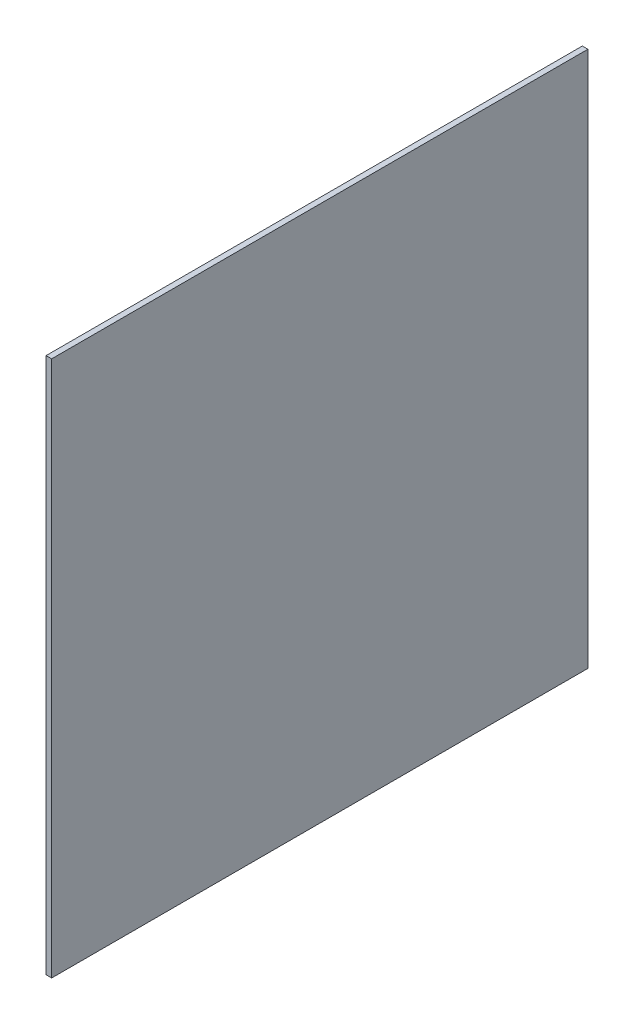
ISO-10303-21;
HEADER;
FILE_DESCRIPTION(('STEP AP214'),'2;1');
FILE_NAME('part.step','',(''),(''),'','','');
FILE_SCHEMA(('AUTOMOTIVE_DESIGN { 1 0 10303 214 1 1 1 1 }'));
ENDSEC;
DATA;
#1=APPLICATION_CONTEXT('core data for automotive mechanical design processes');
#2=APPLICATION_PROTOCOL_DEFINITION('international standard','automotive_design',2000,#1);
#3=PRODUCT_CONTEXT('',#1,'mechanical');
#4=PRODUCT('Part','Part','',(#3));
#5=PRODUCT_RELATED_PRODUCT_CATEGORY('part','',(#4));
#6=PRODUCT_DEFINITION_FORMATION('','',#4);
#7=PRODUCT_DEFINITION_CONTEXT('part definition',#1,'design');
#8=PRODUCT_DEFINITION('design','',#6,#7);
#9=PRODUCT_DEFINITION_SHAPE('','',#8);
#10=(LENGTH_UNIT() NAMED_UNIT(*) SI_UNIT(.MILLI.,.METRE.));
#11=(NAMED_UNIT(*) PLANE_ANGLE_UNIT() SI_UNIT($,.RADIAN.));
#12=(NAMED_UNIT(*) SI_UNIT($,.STERADIAN.) SOLID_ANGLE_UNIT());
#13=UNCERTAINTY_MEASURE_WITH_UNIT(LENGTH_MEASURE(1.E-05),#10,'distance_accuracy_value','');
#14=(GEOMETRIC_REPRESENTATION_CONTEXT(3) GLOBAL_UNCERTAINTY_ASSIGNED_CONTEXT((#13)) GLOBAL_UNIT_ASSIGNED_CONTEXT((#10,
#11,#12)) REPRESENTATION_CONTEXT('',''));
#15=CARTESIAN_POINT('',(0.,0.,0.));
#16=DIRECTION('',(0.,0.,1.));
#17=DIRECTION('',(1.,0.,0.));
#18=AXIS2_PLACEMENT_3D('',#15,#16,#17);
#19=CARTESIAN_POINT('',(1.5875,152.4,152.4));
#20=DIRECTION('',(0.,0.,-1.));
#21=DIRECTION('',(0.,1.,0.));
#22=AXIS2_PLACEMENT_3D('',#19,#20,#21);
#23=PLANE('',#22);
#24=DIRECTION('',(0.,-1.,0.));
#25=VECTOR('',#24,1.);
#26=CARTESIAN_POINT('',(-1.5875,152.4,152.4));
#27=LINE('',#26,#25);
#28=CARTESIAN_POINT('',(-1.5875,152.4,152.4));
#29=VERTEX_POINT('',#28);
#30=CARTESIAN_POINT('',(-1.5875,-152.4,152.4));
#31=VERTEX_POINT('',#30);
#32=EDGE_CURVE('E97',#29,#31,#27,.T.);
#33=ORIENTED_EDGE('',*,*,#32,.T.);
#34=DIRECTION('',(-1.,0.,0.));
#35=VECTOR('',#34,1.);
#36=CARTESIAN_POINT('',(1.5875,-152.4,152.4));
#37=LINE('',#36,#35);
#38=CARTESIAN_POINT('',(1.5875,-152.4,152.4));
#39=VERTEX_POINT('',#38);
#40=EDGE_CURVE('E11',#39,#31,#37,.T.);
#41=ORIENTED_EDGE('',*,*,#40,.F.);
#42=DIRECTION('',(0.,-1.,0.));
#43=VECTOR('',#42,1.);
#44=CARTESIAN_POINT('',(1.5875,152.4,152.4));
#45=LINE('',#44,#43);
#46=CARTESIAN_POINT('',(1.5875,152.4,152.4));
#47=VERTEX_POINT('',#46);
#48=EDGE_CURVE('E85',#47,#39,#45,.T.);
#49=ORIENTED_EDGE('',*,*,#48,.F.);
#50=DIRECTION('',(-1.,0.,0.));
#51=VECTOR('',#50,1.);
#52=CARTESIAN_POINT('',(1.5875,152.4,152.4));
#53=LINE('',#52,#51);
#54=EDGE_CURVE('E93',#47,#29,#53,.T.);
#55=ORIENTED_EDGE('',*,*,#54,.T.);
#56=EDGE_LOOP('',(#33,#41,#49,#55));
#57=FACE_BOUND('',#56,.T.);
#58=ADVANCED_FACE('F34',(#57),#23,.F.);
#59=CARTESIAN_POINT('',(1.5875,-152.4,-152.4));
#60=DIRECTION('',(0.,1.,0.));
#61=DIRECTION('',(0.,0.,1.));
#62=AXIS2_PLACEMENT_3D('',#59,#60,#61);
#63=PLANE('',#62);
#64=DIRECTION('',(0.,0.,-1.));
#65=VECTOR('',#64,1.);
#66=CARTESIAN_POINT('',(-1.5875,-152.4,-152.4));
#67=LINE('',#66,#65);
#68=CARTESIAN_POINT('',(-1.5875,-152.4,-152.4));
#69=VERTEX_POINT('',#68);
#70=EDGE_CURVE('E89',#31,#69,#67,.T.);
#71=ORIENTED_EDGE('',*,*,#70,.T.);
#72=DIRECTION('',(-1.,0.,0.));
#73=VECTOR('',#72,1.);
#74=CARTESIAN_POINT('',(1.5875,-152.4,-152.4));
#75=LINE('',#74,#73);
#76=CARTESIAN_POINT('',(1.5875,-152.4,-152.4));
#77=VERTEX_POINT('',#76);
#78=EDGE_CURVE('E42',#77,#69,#75,.T.);
#79=ORIENTED_EDGE('',*,*,#78,.F.);
#80=DIRECTION('',(0.,0.,-1.));
#81=VECTOR('',#80,1.);
#82=CARTESIAN_POINT('',(1.5875,-152.4,-152.4));
#83=LINE('',#82,#81);
#84=EDGE_CURVE('E80',#39,#77,#83,.T.);
#85=ORIENTED_EDGE('',*,*,#84,.F.);
#86=ORIENTED_EDGE('',*,*,#40,.T.);
#87=EDGE_LOOP('',(#71,#79,#85,#86));
#88=FACE_BOUND('',#87,.T.);
#89=ADVANCED_FACE('F88',(#88),#63,.F.);
#90=CARTESIAN_POINT('',(1.5875,152.4,-152.4));
#91=DIRECTION('',(0.,0.,1.));
#92=DIRECTION('',(0.,-1.,0.));
#93=AXIS2_PLACEMENT_3D('',#90,#91,#92);
#94=PLANE('',#93);
#95=DIRECTION('',(0.,1.,0.));
#96=VECTOR('',#95,1.);
#97=CARTESIAN_POINT('',(-1.5875,152.4,-152.4));
#98=LINE('',#97,#96);
#99=CARTESIAN_POINT('',(-1.5875,152.4,-152.4));
#100=VERTEX_POINT('',#99);
#101=EDGE_CURVE('E67',#69,#100,#98,.T.);
#102=ORIENTED_EDGE('',*,*,#101,.T.);
#103=DIRECTION('',(-1.,0.,0.));
#104=VECTOR('',#103,1.);
#105=CARTESIAN_POINT('',(1.5875,152.4,-152.4));
#106=LINE('',#105,#104);
#107=CARTESIAN_POINT('',(1.5875,152.4,-152.4));
#108=VERTEX_POINT('',#107);
#109=EDGE_CURVE('E90',#108,#100,#106,.T.);
#110=ORIENTED_EDGE('',*,*,#109,.F.);
#111=DIRECTION('',(0.,1.,0.));
#112=VECTOR('',#111,1.);
#113=CARTESIAN_POINT('',(1.5875,152.4,-152.4));
#114=LINE('',#113,#112);
#115=EDGE_CURVE('E83',#77,#108,#114,.T.);
#116=ORIENTED_EDGE('',*,*,#115,.F.);
#117=ORIENTED_EDGE('',*,*,#78,.T.);
#118=EDGE_LOOP('',(#102,#110,#116,#117));
#119=FACE_BOUND('',#118,.T.);
#120=ADVANCED_FACE('F91',(#119),#94,.F.);
#121=CARTESIAN_POINT('',(1.5875,152.4,-152.4));
#122=DIRECTION('',(0.,-1.,0.));
#123=DIRECTION('',(0.,0.,-1.));
#124=AXIS2_PLACEMENT_3D('',#121,#122,#123);
#125=PLANE('',#124);
#126=DIRECTION('',(0.,0.,1.));
#127=VECTOR('',#126,1.);
#128=CARTESIAN_POINT('',(-1.5875,152.4,-152.4));
#129=LINE('',#128,#127);
#130=EDGE_CURVE('E73',#100,#29,#129,.T.);
#131=ORIENTED_EDGE('',*,*,#130,.T.);
#132=ORIENTED_EDGE('',*,*,#54,.F.);
#133=DIRECTION('',(0.,0.,1.));
#134=VECTOR('',#133,1.);
#135=CARTESIAN_POINT('',(1.5875,152.4,-152.4));
#136=LINE('',#135,#134);
#137=EDGE_CURVE('E50',#108,#47,#136,.T.);
#138=ORIENTED_EDGE('',*,*,#137,.F.);
#139=ORIENTED_EDGE('',*,*,#109,.T.);
#140=EDGE_LOOP('',(#131,#132,#138,#139));
#141=FACE_BOUND('',#140,.T.);
#142=ADVANCED_FACE('F104',(#141),#125,.F.);
#143=CARTESIAN_POINT('',(1.5875,-152.4,152.4));
#144=DIRECTION('',(-1.,0.,0.));
#145=DIRECTION('',(0.,0.,1.));
#146=AXIS2_PLACEMENT_3D('',#143,#144,#145);
#147=PLANE('',#146);
#148=ORIENTED_EDGE('',*,*,#48,.T.);
#149=ORIENTED_EDGE('',*,*,#84,.T.);
#150=ORIENTED_EDGE('',*,*,#115,.T.);
#151=ORIENTED_EDGE('',*,*,#137,.T.);
#152=EDGE_LOOP('',(#148,#149,#150,#151));
#153=FACE_BOUND('',#152,.T.);
#154=ADVANCED_FACE('F81',(#153),#147,.F.);
#155=CARTESIAN_POINT('',(-1.5875,-152.4,152.4));
#156=DIRECTION('',(-1.,0.,0.));
#157=DIRECTION('',(0.,0.,1.));
#158=AXIS2_PLACEMENT_3D('',#155,#156,#157);
#159=PLANE('',#158);
#160=ORIENTED_EDGE('',*,*,#32,.F.);
#161=ORIENTED_EDGE('',*,*,#130,.F.);
#162=ORIENTED_EDGE('',*,*,#101,.F.);
#163=ORIENTED_EDGE('',*,*,#70,.F.);
#164=EDGE_LOOP('',(#160,#161,#162,#163));
#165=FACE_BOUND('',#164,.T.);
#166=ADVANCED_FACE('F107',(#165),#159,.T.);
#167=CLOSED_SHELL('',(#58,#89,#120,#142,#154,#166));
#168=MANIFOLD_SOLID_BREP('B2',#167);
#169=ADVANCED_BREP_SHAPE_REPRESENTATION('',(#18,#168),#14);
#170=SHAPE_DEFINITION_REPRESENTATION(#9,#169);
ENDSEC;
END-ISO-10303-21;
